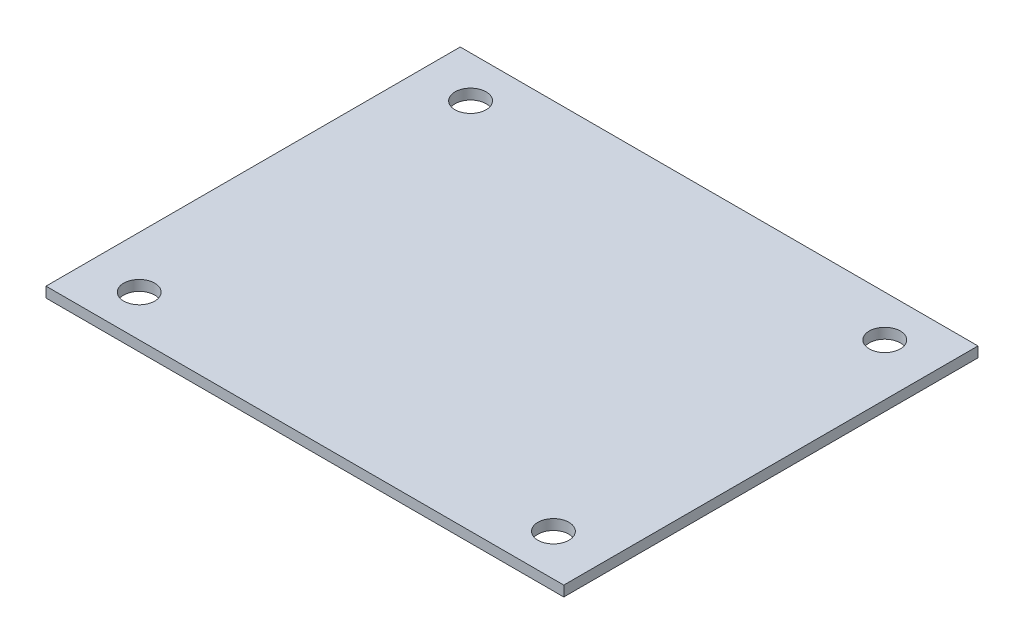
ISO-10303-21;
HEADER;
FILE_DESCRIPTION(('STEP AP214'),'2;1');
FILE_NAME('part.step','',(''),(''),'','','');
FILE_SCHEMA(('AUTOMOTIVE_DESIGN { 1 0 10303 214 1 1 1 1 }'));
ENDSEC;
DATA;
#1=APPLICATION_CONTEXT('core data for automotive mechanical design processes');
#2=APPLICATION_PROTOCOL_DEFINITION('international standard','automotive_design',2000,#1);
#3=PRODUCT_CONTEXT('',#1,'mechanical');
#4=PRODUCT('Part','Part','',(#3));
#5=PRODUCT_RELATED_PRODUCT_CATEGORY('part','',(#4));
#6=PRODUCT_DEFINITION_FORMATION('','',#4);
#7=PRODUCT_DEFINITION_CONTEXT('part definition',#1,'design');
#8=PRODUCT_DEFINITION('design','',#6,#7);
#9=PRODUCT_DEFINITION_SHAPE('','',#8);
#10=(LENGTH_UNIT() NAMED_UNIT(*) SI_UNIT(.MILLI.,.METRE.));
#11=(NAMED_UNIT(*) PLANE_ANGLE_UNIT() SI_UNIT($,.RADIAN.));
#12=(NAMED_UNIT(*) SI_UNIT($,.STERADIAN.) SOLID_ANGLE_UNIT());
#13=UNCERTAINTY_MEASURE_WITH_UNIT(LENGTH_MEASURE(1.E-05),#10,'distance_accuracy_value','');
#14=(GEOMETRIC_REPRESENTATION_CONTEXT(3) GLOBAL_UNCERTAINTY_ASSIGNED_CONTEXT((#13)) GLOBAL_UNIT_ASSIGNED_CONTEXT((#10,
#11,#12)) REPRESENTATION_CONTEXT('',''));
#15=CARTESIAN_POINT('',(0.,0.,0.));
#16=DIRECTION('',(0.,0.,1.));
#17=DIRECTION('',(1.,0.,0.));
#18=AXIS2_PLACEMENT_3D('',#15,#16,#17);
#19=CARTESIAN_POINT('',(0.,1.,0.));
#20=DIRECTION('',(0.,1.,0.));
#21=DIRECTION('',(0.,0.,1.));
#22=AXIS2_PLACEMENT_3D('',#19,#20,#21);
#23=PLANE('',#22);
#24=CARTESIAN_POINT('',(20.,1.,16.));
#25=DIRECTION('',(0.,1.,0.));
#26=DIRECTION('',(0.,0.,-1.));
#27=AXIS2_PLACEMENT_3D('',#24,#25,#26);
#28=CIRCLE('',#27,1.5);
#29=CARTESIAN_POINT('',(20.,1.,14.5));
#30=VERTEX_POINT('',#29);
#31=EDGE_CURVE('E121',#30,#30,#28,.T.);
#32=ORIENTED_EDGE('',*,*,#31,.F.);
#33=EDGE_LOOP('',(#32));
#34=FACE_BOUND('',#33,.T.);
#35=CARTESIAN_POINT('',(-20.,1.,-16.));
#36=DIRECTION('',(0.,1.,0.));
#37=DIRECTION('',(0.,0.,-1.));
#38=AXIS2_PLACEMENT_3D('',#35,#36,#37);
#39=CIRCLE('',#38,1.5);
#40=CARTESIAN_POINT('',(-20.,1.,-17.5));
#41=VERTEX_POINT('',#40);
#42=EDGE_CURVE('E100',#41,#41,#39,.T.);
#43=ORIENTED_EDGE('',*,*,#42,.F.);
#44=EDGE_LOOP('',(#43));
#45=FACE_BOUND('',#44,.T.);
#46=DIRECTION('',(0.,0.,-1.));
#47=VECTOR('',#46,1.);
#48=CARTESIAN_POINT('',(25.,1.,-20.));
#49=LINE('',#48,#47);
#50=CARTESIAN_POINT('',(25.,1.,20.));
#51=VERTEX_POINT('',#50);
#52=CARTESIAN_POINT('',(25.,1.,-20.));
#53=VERTEX_POINT('',#52);
#54=EDGE_CURVE('E85',#51,#53,#49,.T.);
#55=ORIENTED_EDGE('',*,*,#54,.T.);
#56=DIRECTION('',(-1.,0.,0.));
#57=VECTOR('',#56,1.);
#58=CARTESIAN_POINT('',(-25.,1.,-20.));
#59=LINE('',#58,#57);
#60=CARTESIAN_POINT('',(-25.,1.,-20.));
#61=VERTEX_POINT('',#60);
#62=EDGE_CURVE('E80',#53,#61,#59,.T.);
#63=ORIENTED_EDGE('',*,*,#62,.T.);
#64=DIRECTION('',(0.,0.,1.));
#65=VECTOR('',#64,1.);
#66=CARTESIAN_POINT('',(-25.,1.,-20.));
#67=LINE('',#66,#65);
#68=CARTESIAN_POINT('',(-25.,1.,20.));
#69=VERTEX_POINT('',#68);
#70=EDGE_CURVE('E83',#61,#69,#67,.T.);
#71=ORIENTED_EDGE('',*,*,#70,.T.);
#72=DIRECTION('',(1.,0.,0.));
#73=VECTOR('',#72,1.);
#74=CARTESIAN_POINT('',(-25.,1.,20.));
#75=LINE('',#74,#73);
#76=EDGE_CURVE('E50',#69,#51,#75,.T.);
#77=ORIENTED_EDGE('',*,*,#76,.T.);
#78=EDGE_LOOP('',(#55,#63,#71,#77));
#79=FACE_BOUND('',#78,.T.);
#80=CARTESIAN_POINT('',(-20.,1.,16.));
#81=DIRECTION('',(0.,1.,0.));
#82=DIRECTION('',(0.,0.,1.));
#83=AXIS2_PLACEMENT_3D('',#80,#81,#82);
#84=CIRCLE('',#83,1.5);
#85=CARTESIAN_POINT('',(-20.,1.,17.5));
#86=VERTEX_POINT('',#85);
#87=EDGE_CURVE('E115',#86,#86,#84,.T.);
#88=ORIENTED_EDGE('',*,*,#87,.F.);
#89=EDGE_LOOP('',(#88));
#90=FACE_BOUND('',#89,.T.);
#91=CARTESIAN_POINT('',(20.,1.,-16.));
#92=DIRECTION('',(0.,1.,0.));
#93=DIRECTION('',(0.,0.,1.));
#94=AXIS2_PLACEMENT_3D('',#91,#92,#93);
#95=CIRCLE('',#94,1.5);
#96=CARTESIAN_POINT('',(20.,1.,-14.5));
#97=VERTEX_POINT('',#96);
#98=EDGE_CURVE('E127',#97,#97,#95,.T.);
#99=ORIENTED_EDGE('',*,*,#98,.F.);
#100=EDGE_LOOP('',(#99));
#101=FACE_BOUND('',#100,.T.);
#102=ADVANCED_FACE('F33',(#34,#45,#79,#90,#101),#23,.T.);
#103=CARTESIAN_POINT('',(0.,0.,0.));
#104=DIRECTION('',(0.,1.,0.));
#105=DIRECTION('',(0.,0.,1.));
#106=AXIS2_PLACEMENT_3D('',#103,#104,#105);
#107=PLANE('',#106);
#108=DIRECTION('',(0.,0.,-1.));
#109=VECTOR('',#108,1.);
#110=CARTESIAN_POINT('',(25.,0.,-20.));
#111=LINE('',#110,#109);
#112=CARTESIAN_POINT('',(25.,0.,20.));
#113=VERTEX_POINT('',#112);
#114=CARTESIAN_POINT('',(25.,0.,-20.));
#115=VERTEX_POINT('',#114);
#116=EDGE_CURVE('E97',#113,#115,#111,.T.);
#117=ORIENTED_EDGE('',*,*,#116,.F.);
#118=DIRECTION('',(1.,0.,0.));
#119=VECTOR('',#118,1.);
#120=CARTESIAN_POINT('',(-25.,0.,20.));
#121=LINE('',#120,#119);
#122=CARTESIAN_POINT('',(-25.,0.,20.));
#123=VERTEX_POINT('',#122);
#124=EDGE_CURVE('E73',#123,#113,#121,.T.);
#125=ORIENTED_EDGE('',*,*,#124,.F.);
#126=DIRECTION('',(0.,0.,1.));
#127=VECTOR('',#126,1.);
#128=CARTESIAN_POINT('',(-25.,0.,-20.));
#129=LINE('',#128,#127);
#130=CARTESIAN_POINT('',(-25.,0.,-20.));
#131=VERTEX_POINT('',#130);
#132=EDGE_CURVE('E67',#131,#123,#129,.T.);
#133=ORIENTED_EDGE('',*,*,#132,.F.);
#134=DIRECTION('',(-1.,0.,0.));
#135=VECTOR('',#134,1.);
#136=CARTESIAN_POINT('',(-25.,0.,-20.));
#137=LINE('',#136,#135);
#138=EDGE_CURVE('E89',#115,#131,#137,.T.);
#139=ORIENTED_EDGE('',*,*,#138,.F.);
#140=EDGE_LOOP('',(#117,#125,#133,#139));
#141=FACE_BOUND('',#140,.T.);
#142=CARTESIAN_POINT('',(-20.,0.,-16.));
#143=DIRECTION('',(0.,1.,0.));
#144=DIRECTION('',(0.,0.,-1.));
#145=AXIS2_PLACEMENT_3D('',#142,#143,#144);
#146=CIRCLE('',#145,1.5);
#147=CARTESIAN_POINT('',(-20.,0.,-17.5));
#148=VERTEX_POINT('',#147);
#149=EDGE_CURVE('E112',#148,#148,#146,.T.);
#150=ORIENTED_EDGE('',*,*,#149,.T.);
#151=EDGE_LOOP('',(#150));
#152=FACE_BOUND('',#151,.T.);
#153=CARTESIAN_POINT('',(-20.,0.,16.));
#154=DIRECTION('',(0.,1.,0.));
#155=DIRECTION('',(0.,0.,1.));
#156=AXIS2_PLACEMENT_3D('',#153,#154,#155);
#157=CIRCLE('',#156,1.5);
#158=CARTESIAN_POINT('',(-20.,0.,17.5));
#159=VERTEX_POINT('',#158);
#160=EDGE_CURVE('E118',#159,#159,#157,.T.);
#161=ORIENTED_EDGE('',*,*,#160,.T.);
#162=EDGE_LOOP('',(#161));
#163=FACE_BOUND('',#162,.T.);
#164=CARTESIAN_POINT('',(20.,0.,16.));
#165=DIRECTION('',(0.,1.,0.));
#166=DIRECTION('',(0.,0.,-1.));
#167=AXIS2_PLACEMENT_3D('',#164,#165,#166);
#168=CIRCLE('',#167,1.5);
#169=CARTESIAN_POINT('',(20.,0.,14.5));
#170=VERTEX_POINT('',#169);
#171=EDGE_CURVE('E124',#170,#170,#168,.T.);
#172=ORIENTED_EDGE('',*,*,#171,.T.);
#173=EDGE_LOOP('',(#172));
#174=FACE_BOUND('',#173,.T.);
#175=CARTESIAN_POINT('',(20.,0.,-16.));
#176=DIRECTION('',(0.,1.,0.));
#177=DIRECTION('',(0.,0.,1.));
#178=AXIS2_PLACEMENT_3D('',#175,#176,#177);
#179=CIRCLE('',#178,1.5);
#180=CARTESIAN_POINT('',(20.,0.,-14.5));
#181=VERTEX_POINT('',#180);
#182=EDGE_CURVE('E130',#181,#181,#179,.T.);
#183=ORIENTED_EDGE('',*,*,#182,.T.);
#184=EDGE_LOOP('',(#183));
#185=FACE_BOUND('',#184,.T.);
#186=ADVANCED_FACE('F108',(#141,#152,#163,#174,#185),#107,.F.);
#187=CARTESIAN_POINT('',(25.,1.,-20.));
#188=DIRECTION('',(-1.,0.,0.));
#189=DIRECTION('',(0.,0.,1.));
#190=AXIS2_PLACEMENT_3D('',#187,#188,#189);
#191=PLANE('',#190);
#192=ORIENTED_EDGE('',*,*,#116,.T.);
#193=DIRECTION('',(0.,-1.,0.));
#194=VECTOR('',#193,1.);
#195=CARTESIAN_POINT('',(25.,1.,-20.));
#196=LINE('',#195,#194);
#197=EDGE_CURVE('E11',#53,#115,#196,.T.);
#198=ORIENTED_EDGE('',*,*,#197,.F.);
#199=ORIENTED_EDGE('',*,*,#54,.F.);
#200=DIRECTION('',(0.,-1.,0.));
#201=VECTOR('',#200,1.);
#202=CARTESIAN_POINT('',(25.,1.,20.));
#203=LINE('',#202,#201);
#204=EDGE_CURVE('E93',#51,#113,#203,.T.);
#205=ORIENTED_EDGE('',*,*,#204,.T.);
#206=EDGE_LOOP('',(#192,#198,#199,#205));
#207=FACE_BOUND('',#206,.T.);
#208=ADVANCED_FACE('F35',(#207),#191,.F.);
#209=CARTESIAN_POINT('',(-25.,1.,-20.));
#210=DIRECTION('',(0.,0.,1.));
#211=DIRECTION('',(1.,0.,0.));
#212=AXIS2_PLACEMENT_3D('',#209,#210,#211);
#213=PLANE('',#212);
#214=ORIENTED_EDGE('',*,*,#138,.T.);
#215=DIRECTION('',(0.,-1.,0.));
#216=VECTOR('',#215,1.);
#217=CARTESIAN_POINT('',(-25.,1.,-20.));
#218=LINE('',#217,#216);
#219=EDGE_CURVE('E42',#61,#131,#218,.T.);
#220=ORIENTED_EDGE('',*,*,#219,.F.);
#221=ORIENTED_EDGE('',*,*,#62,.F.);
#222=ORIENTED_EDGE('',*,*,#197,.T.);
#223=EDGE_LOOP('',(#214,#220,#221,#222));
#224=FACE_BOUND('',#223,.T.);
#225=ADVANCED_FACE('F88',(#224),#213,.F.);
#226=CARTESIAN_POINT('',(-25.,1.,-20.));
#227=DIRECTION('',(1.,0.,0.));
#228=DIRECTION('',(0.,0.,-1.));
#229=AXIS2_PLACEMENT_3D('',#226,#227,#228);
#230=PLANE('',#229);
#231=ORIENTED_EDGE('',*,*,#132,.T.);
#232=DIRECTION('',(0.,-1.,0.));
#233=VECTOR('',#232,1.);
#234=CARTESIAN_POINT('',(-25.,1.,20.));
#235=LINE('',#234,#233);
#236=EDGE_CURVE('E90',#69,#123,#235,.T.);
#237=ORIENTED_EDGE('',*,*,#236,.F.);
#238=ORIENTED_EDGE('',*,*,#70,.F.);
#239=ORIENTED_EDGE('',*,*,#219,.T.);
#240=EDGE_LOOP('',(#231,#237,#238,#239));
#241=FACE_BOUND('',#240,.T.);
#242=ADVANCED_FACE('F91',(#241),#230,.F.);
#243=CARTESIAN_POINT('',(-25.,1.,20.));
#244=DIRECTION('',(0.,0.,-1.));
#245=DIRECTION('',(-1.,0.,0.));
#246=AXIS2_PLACEMENT_3D('',#243,#244,#245);
#247=PLANE('',#246);
#248=ORIENTED_EDGE('',*,*,#124,.T.);
#249=ORIENTED_EDGE('',*,*,#204,.F.);
#250=ORIENTED_EDGE('',*,*,#76,.F.);
#251=ORIENTED_EDGE('',*,*,#236,.T.);
#252=EDGE_LOOP('',(#248,#249,#250,#251));
#253=FACE_BOUND('',#252,.T.);
#254=ADVANCED_FACE('F105',(#253),#247,.F.);
#255=CARTESIAN_POINT('',(-20.,1.,-16.));
#256=DIRECTION('',(0.,-1.,0.));
#257=DIRECTION('',(0.,0.,-1.));
#258=AXIS2_PLACEMENT_3D('',#255,#256,#257);
#259=CYLINDRICAL_SURFACE('',#258,1.5);
#260=ORIENTED_EDGE('',*,*,#42,.T.);
#261=EDGE_LOOP('',(#260));
#262=FACE_BOUND('',#261,.T.);
#263=ORIENTED_EDGE('',*,*,#149,.F.);
#264=EDGE_LOOP('',(#263));
#265=FACE_BOUND('',#264,.T.);
#266=ADVANCED_FACE('F149',(#262,#265),#259,.F.);
#267=CARTESIAN_POINT('',(-20.,1.,16.));
#268=DIRECTION('',(0.,-1.,0.));
#269=DIRECTION('',(0.,0.,-1.));
#270=AXIS2_PLACEMENT_3D('',#267,#268,#269);
#271=CYLINDRICAL_SURFACE('',#270,1.5);
#272=ORIENTED_EDGE('',*,*,#87,.T.);
#273=EDGE_LOOP('',(#272));
#274=FACE_BOUND('',#273,.T.);
#275=ORIENTED_EDGE('',*,*,#160,.F.);
#276=EDGE_LOOP('',(#275));
#277=FACE_BOUND('',#276,.T.);
#278=ADVANCED_FACE('F195',(#274,#277),#271,.F.);
#279=CARTESIAN_POINT('',(20.,1.,16.));
#280=DIRECTION('',(0.,-1.,0.));
#281=DIRECTION('',(0.,0.,-1.));
#282=AXIS2_PLACEMENT_3D('',#279,#280,#281);
#283=CYLINDRICAL_SURFACE('',#282,1.5);
#284=ORIENTED_EDGE('',*,*,#31,.T.);
#285=EDGE_LOOP('',(#284));
#286=FACE_BOUND('',#285,.T.);
#287=ORIENTED_EDGE('',*,*,#171,.F.);
#288=EDGE_LOOP('',(#287));
#289=FACE_BOUND('',#288,.T.);
#290=ADVANCED_FACE('F203',(#286,#289),#283,.F.);
#291=CARTESIAN_POINT('',(20.,1.,-16.));
#292=DIRECTION('',(0.,-1.,0.));
#293=DIRECTION('',(0.,0.,-1.));
#294=AXIS2_PLACEMENT_3D('',#291,#292,#293);
#295=CYLINDRICAL_SURFACE('',#294,1.5);
#296=ORIENTED_EDGE('',*,*,#98,.T.);
#297=EDGE_LOOP('',(#296));
#298=FACE_BOUND('',#297,.T.);
#299=ORIENTED_EDGE('',*,*,#182,.F.);
#300=EDGE_LOOP('',(#299));
#301=FACE_BOUND('',#300,.T.);
#302=ADVANCED_FACE('F136',(#298,#301),#295,.F.);
#303=CLOSED_SHELL('',(#102,#186,#208,#225,#242,#254,#266,#278,#290,#302));
#304=MANIFOLD_SOLID_BREP('B2',#303);
#305=ADVANCED_BREP_SHAPE_REPRESENTATION('',(#18,#304),#14);
#306=SHAPE_DEFINITION_REPRESENTATION(#9,#305);
ENDSEC;
END-ISO-10303-21;
